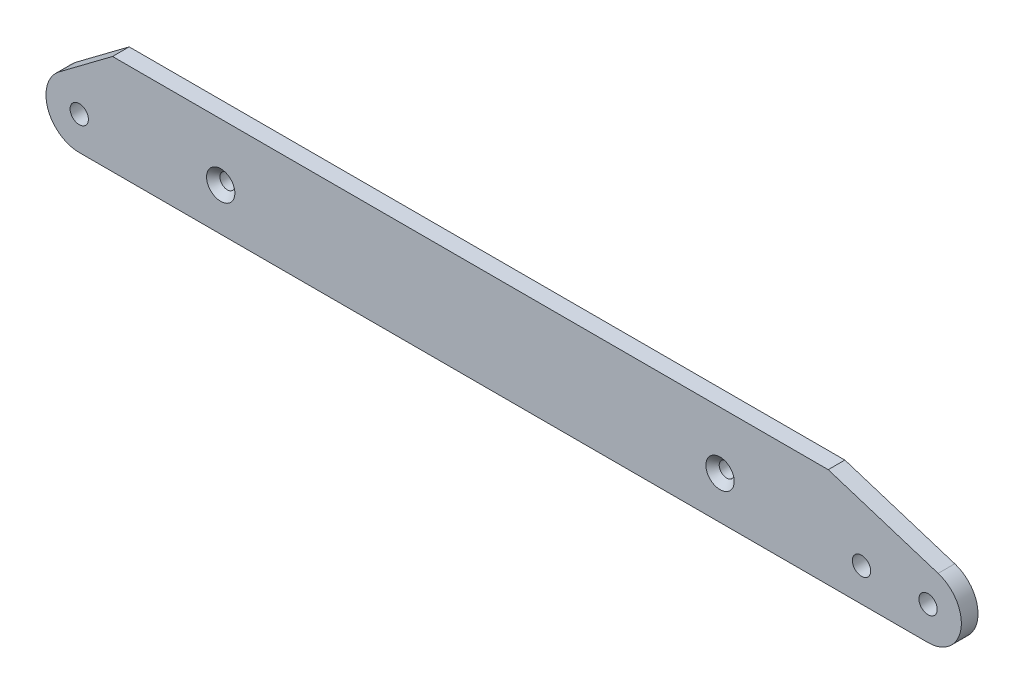
ISO-10303-21;
HEADER;
FILE_DESCRIPTION(('STEP AP214'),'2;1');
FILE_NAME('part.step','',(''),(''),'','','');
FILE_SCHEMA(('AUTOMOTIVE_DESIGN { 1 0 10303 214 1 1 1 1 }'));
ENDSEC;
DATA;
#1=APPLICATION_CONTEXT('core data for automotive mechanical design processes');
#2=APPLICATION_PROTOCOL_DEFINITION('international standard','automotive_design',2000,#1);
#3=PRODUCT_CONTEXT('',#1,'mechanical');
#4=PRODUCT('Part','Part','',(#3));
#5=PRODUCT_RELATED_PRODUCT_CATEGORY('part','',(#4));
#6=PRODUCT_DEFINITION_FORMATION('','',#4);
#7=PRODUCT_DEFINITION_CONTEXT('part definition',#1,'design');
#8=PRODUCT_DEFINITION('design','',#6,#7);
#9=PRODUCT_DEFINITION_SHAPE('','',#8);
#10=(LENGTH_UNIT() NAMED_UNIT(*) SI_UNIT(.MILLI.,.METRE.));
#11=(NAMED_UNIT(*) PLANE_ANGLE_UNIT() SI_UNIT($,.RADIAN.));
#12=(NAMED_UNIT(*) SI_UNIT($,.STERADIAN.) SOLID_ANGLE_UNIT());
#13=UNCERTAINTY_MEASURE_WITH_UNIT(LENGTH_MEASURE(1.E-05),#10,'distance_accuracy_value','');
#14=(GEOMETRIC_REPRESENTATION_CONTEXT(3) GLOBAL_UNCERTAINTY_ASSIGNED_CONTEXT((#13)) GLOBAL_UNIT_ASSIGNED_CONTEXT((#10,
#11,#12)) REPRESENTATION_CONTEXT('',''));
#15=CARTESIAN_POINT('',(0.,0.,0.));
#16=DIRECTION('',(0.,0.,1.));
#17=DIRECTION('',(1.,0.,0.));
#18=AXIS2_PLACEMENT_3D('',#15,#16,#17);
#19=CARTESIAN_POINT('',(-117.5,-2.79999999999998,2.5));
#20=DIRECTION('',(0.,0.,1.));
#21=DIRECTION('',(1.,0.,0.));
#22=AXIS2_PLACEMENT_3D('',#19,#20,#21);
#23=PLANE('',#22);
#24=CARTESIAN_POINT('',(75.,0.,2.5));
#25=DIRECTION('',(0.,0.,1.));
#26=DIRECTION('',(1.,0.,0.));
#27=AXIS2_PLACEMENT_3D('',#24,#25,#26);
#28=CIRCLE('',#27,4.25000000000003);
#29=CARTESIAN_POINT('',(79.25,0.,2.5));
#30=VERTEX_POINT('',#29);
#31=EDGE_CURVE('E49',#30,#30,#28,.F.);
#32=ORIENTED_EDGE('',*,*,#31,.T.);
#33=EDGE_LOOP('',(#32));
#34=FACE_BOUND('',#33,.T.);
#35=CARTESIAN_POINT('',(-75.,0.,2.5));
#36=DIRECTION('',(0.,0.,1.));
#37=DIRECTION('',(1.,0.,0.));
#38=AXIS2_PLACEMENT_3D('',#35,#36,#37);
#39=CIRCLE('',#38,4.25000000000003);
#40=CARTESIAN_POINT('',(-70.75,0.,2.5));
#41=VERTEX_POINT('',#40);
#42=EDGE_CURVE('E149',#41,#41,#39,.F.);
#43=ORIENTED_EDGE('',*,*,#42,.T.);
#44=EDGE_LOOP('',(#43));
#45=FACE_BOUND('',#44,.T.);
#46=CARTESIAN_POINT('',(117.5,-2.79999999999999,2.5));
#47=DIRECTION('',(0.,0.,1.));
#48=DIRECTION('',(1.,0.,0.));
#49=AXIS2_PLACEMENT_3D('',#46,#47,#48);
#50=CIRCLE('',#49,2.75000000000001);
#51=CARTESIAN_POINT('',(120.25,-2.79999999999999,2.5));
#52=VERTEX_POINT('',#51);
#53=EDGE_CURVE('E234',#52,#52,#50,.T.);
#54=ORIENTED_EDGE('',*,*,#53,.F.);
#55=EDGE_LOOP('',(#54));
#56=FACE_BOUND('',#55,.T.);
#57=CARTESIAN_POINT('',(-117.5,-2.79999999999998,2.5));
#58=DIRECTION('',(0.,0.,1.));
#59=DIRECTION('',(1.,0.,0.));
#60=AXIS2_PLACEMENT_3D('',#57,#58,#59);
#61=CIRCLE('',#60,10.);
#62=CARTESIAN_POINT('',(-123.5,5.20000000000004,2.5));
#63=VERTEX_POINT('',#62);
#64=CARTESIAN_POINT('',(-117.5,-12.8,2.5));
#65=VERTEX_POINT('',#64);
#66=EDGE_CURVE('E137',#63,#65,#61,.T.);
#67=ORIENTED_EDGE('',*,*,#66,.T.);
#68=DIRECTION('',(1.,0.,0.));
#69=VECTOR('',#68,1.);
#70=CARTESIAN_POINT('',(-117.5,-12.8,2.5));
#71=LINE('',#70,#69);
#72=CARTESIAN_POINT('',(137.5,-12.8,2.5));
#73=VERTEX_POINT('',#72);
#74=EDGE_CURVE('E95',#65,#73,#71,.T.);
#75=ORIENTED_EDGE('',*,*,#74,.T.);
#76=CARTESIAN_POINT('',(137.5,-2.80000000000002,2.5));
#77=DIRECTION('',(0.,0.,1.));
#78=DIRECTION('',(1.,0.,0.));
#79=AXIS2_PLACEMENT_3D('',#76,#77,#78);
#80=CIRCLE('',#79,10.);
#81=CARTESIAN_POINT('',(140.52169479252,6.73254218877941,2.5));
#82=VERTEX_POINT('',#81);
#83=EDGE_CURVE('E108',#73,#82,#80,.T.);
#84=ORIENTED_EDGE('',*,*,#83,.T.);
#85=DIRECTION('',(-0.953254218877943,0.302169479251963,0.));
#86=VECTOR('',#85,1.);
#87=CARTESIAN_POINT('',(107.5,17.2,2.5));
#88=LINE('',#87,#86);
#89=CARTESIAN_POINT('',(107.5,17.2,2.5));
#90=VERTEX_POINT('',#89);
#91=EDGE_CURVE('E102',#82,#90,#88,.T.);
#92=ORIENTED_EDGE('',*,*,#91,.T.);
#93=DIRECTION('',(-1.,0.,0.));
#94=VECTOR('',#93,1.);
#95=CARTESIAN_POINT('',(107.5,17.2,2.5));
#96=LINE('',#95,#94);
#97=CARTESIAN_POINT('',(-107.5,17.2,2.5));
#98=VERTEX_POINT('',#97);
#99=EDGE_CURVE('E106',#90,#98,#96,.T.);
#100=ORIENTED_EDGE('',*,*,#99,.T.);
#101=DIRECTION('',(-0.800000000000001,-0.599999999999998,0.));
#102=VECTOR('',#101,1.);
#103=CARTESIAN_POINT('',(-107.5,17.2,2.5));
#104=LINE('',#103,#102);
#105=EDGE_CURVE('E57',#98,#63,#104,.T.);
#106=ORIENTED_EDGE('',*,*,#105,.T.);
#107=EDGE_LOOP('',(#67,#75,#84,#92,#100,#106));
#108=FACE_BOUND('',#107,.T.);
#109=CARTESIAN_POINT('',(-117.5,-2.79999999999998,2.5));
#110=DIRECTION('',(0.,0.,1.));
#111=DIRECTION('',(1.,0.,0.));
#112=AXIS2_PLACEMENT_3D('',#109,#110,#111);
#113=CIRCLE('',#112,2.75000000000001);
#114=CARTESIAN_POINT('',(-114.75,-2.79999999999998,2.5));
#115=VERTEX_POINT('',#114);
#116=EDGE_CURVE('E172',#115,#115,#113,.T.);
#117=ORIENTED_EDGE('',*,*,#116,.F.);
#118=EDGE_LOOP('',(#117));
#119=FACE_BOUND('',#118,.T.);
#120=CARTESIAN_POINT('',(137.5,-2.80000000000002,2.5));
#121=DIRECTION('',(0.,0.,1.));
#122=DIRECTION('',(1.,0.,0.));
#123=AXIS2_PLACEMENT_3D('',#120,#121,#122);
#124=CIRCLE('',#123,2.75000000000001);
#125=CARTESIAN_POINT('',(140.25,-2.80000000000002,2.5));
#126=VERTEX_POINT('',#125);
#127=EDGE_CURVE('E225',#126,#126,#124,.T.);
#128=ORIENTED_EDGE('',*,*,#127,.F.);
#129=EDGE_LOOP('',(#128));
#130=FACE_BOUND('',#129,.T.);
#131=ADVANCED_FACE('F39',(#34,#45,#56,#108,#119,#130),#23,.T.);
#132=CARTESIAN_POINT('',(-117.5,-2.79999999999998,-2.5));
#133=DIRECTION('',(0.,0.,1.));
#134=DIRECTION('',(1.,0.,0.));
#135=AXIS2_PLACEMENT_3D('',#132,#133,#134);
#136=PLANE('',#135);
#137=CARTESIAN_POINT('',(-117.5,-2.79999999999998,-2.5));
#138=DIRECTION('',(0.,0.,1.));
#139=DIRECTION('',(1.,0.,0.));
#140=AXIS2_PLACEMENT_3D('',#137,#138,#139);
#141=CIRCLE('',#140,10.);
#142=CARTESIAN_POINT('',(-123.5,5.20000000000004,-2.5));
#143=VERTEX_POINT('',#142);
#144=CARTESIAN_POINT('',(-117.5,-12.8,-2.5));
#145=VERTEX_POINT('',#144);
#146=EDGE_CURVE('E126',#143,#145,#141,.T.);
#147=ORIENTED_EDGE('',*,*,#146,.F.);
#148=DIRECTION('',(-0.800000000000001,-0.599999999999998,0.));
#149=VECTOR('',#148,1.);
#150=CARTESIAN_POINT('',(-107.5,17.2,-2.5));
#151=LINE('',#150,#149);
#152=CARTESIAN_POINT('',(-107.5,17.2,-2.5));
#153=VERTEX_POINT('',#152);
#154=EDGE_CURVE('E86',#153,#143,#151,.T.);
#155=ORIENTED_EDGE('',*,*,#154,.F.);
#156=DIRECTION('',(-1.,0.,0.));
#157=VECTOR('',#156,1.);
#158=CARTESIAN_POINT('',(107.5,17.2,-2.5));
#159=LINE('',#158,#157);
#160=CARTESIAN_POINT('',(107.5,17.2,-2.5));
#161=VERTEX_POINT('',#160);
#162=EDGE_CURVE('E80',#161,#153,#159,.T.);
#163=ORIENTED_EDGE('',*,*,#162,.F.);
#164=DIRECTION('',(-0.953254218877943,0.302169479251963,0.));
#165=VECTOR('',#164,1.);
#166=CARTESIAN_POINT('',(107.5,17.2,-2.5));
#167=LINE('',#166,#165);
#168=CARTESIAN_POINT('',(140.52169479252,6.73254218877941,-2.5));
#169=VERTEX_POINT('',#168);
#170=EDGE_CURVE('E116',#169,#161,#167,.T.);
#171=ORIENTED_EDGE('',*,*,#170,.F.);
#172=CARTESIAN_POINT('',(137.5,-2.80000000000002,-2.5));
#173=DIRECTION('',(0.,0.,1.));
#174=DIRECTION('',(1.,0.,0.));
#175=AXIS2_PLACEMENT_3D('',#172,#173,#174);
#176=CIRCLE('',#175,10.);
#177=CARTESIAN_POINT('',(137.5,-12.8,-2.5));
#178=VERTEX_POINT('',#177);
#179=EDGE_CURVE('E132',#178,#169,#176,.T.);
#180=ORIENTED_EDGE('',*,*,#179,.F.);
#181=DIRECTION('',(1.,0.,0.));
#182=VECTOR('',#181,1.);
#183=CARTESIAN_POINT('',(-117.5,-12.8,-2.5));
#184=LINE('',#183,#182);
#185=EDGE_CURVE('E129',#145,#178,#184,.T.);
#186=ORIENTED_EDGE('',*,*,#185,.F.);
#187=EDGE_LOOP('',(#147,#155,#163,#171,#180,#186));
#188=FACE_BOUND('',#187,.T.);
#189=CARTESIAN_POINT('',(-75.,0.,-2.5));
#190=DIRECTION('',(0.,0.,1.));
#191=DIRECTION('',(1.,0.,0.));
#192=AXIS2_PLACEMENT_3D('',#189,#190,#191);
#193=CIRCLE('',#192,2.25);
#194=CARTESIAN_POINT('',(-72.75,0.,-2.5));
#195=VERTEX_POINT('',#194);
#196=EDGE_CURVE('E130',#195,#195,#193,.T.);
#197=ORIENTED_EDGE('',*,*,#196,.T.);
#198=EDGE_LOOP('',(#197));
#199=FACE_BOUND('',#198,.T.);
#200=CARTESIAN_POINT('',(75.,0.,-2.5));
#201=DIRECTION('',(0.,0.,1.));
#202=DIRECTION('',(1.,0.,0.));
#203=AXIS2_PLACEMENT_3D('',#200,#201,#202);
#204=CIRCLE('',#203,2.25);
#205=CARTESIAN_POINT('',(77.25,0.,-2.5));
#206=VERTEX_POINT('',#205);
#207=EDGE_CURVE('E170',#206,#206,#204,.T.);
#208=ORIENTED_EDGE('',*,*,#207,.T.);
#209=EDGE_LOOP('',(#208));
#210=FACE_BOUND('',#209,.T.);
#211=CARTESIAN_POINT('',(-117.5,-2.79999999999998,-2.5));
#212=DIRECTION('',(0.,0.,1.));
#213=DIRECTION('',(1.,0.,0.));
#214=AXIS2_PLACEMENT_3D('',#211,#212,#213);
#215=CIRCLE('',#214,2.75000000000001);
#216=CARTESIAN_POINT('',(-114.75,-2.79999999999998,-2.5));
#217=VERTEX_POINT('',#216);
#218=EDGE_CURVE('E177',#217,#217,#215,.T.);
#219=ORIENTED_EDGE('',*,*,#218,.T.);
#220=EDGE_LOOP('',(#219));
#221=FACE_BOUND('',#220,.T.);
#222=CARTESIAN_POINT('',(117.5,-2.79999999999999,-2.5));
#223=DIRECTION('',(0.,0.,1.));
#224=DIRECTION('',(1.,0.,0.));
#225=AXIS2_PLACEMENT_3D('',#222,#223,#224);
#226=CIRCLE('',#225,2.75000000000001);
#227=CARTESIAN_POINT('',(120.25,-2.79999999999999,-2.5));
#228=VERTEX_POINT('',#227);
#229=EDGE_CURVE('E231',#228,#228,#226,.T.);
#230=ORIENTED_EDGE('',*,*,#229,.T.);
#231=EDGE_LOOP('',(#230));
#232=FACE_BOUND('',#231,.T.);
#233=CARTESIAN_POINT('',(137.5,-2.80000000000002,-2.5));
#234=DIRECTION('',(0.,0.,1.));
#235=DIRECTION('',(1.,0.,0.));
#236=AXIS2_PLACEMENT_3D('',#233,#234,#235);
#237=CIRCLE('',#236,2.75000000000001);
#238=CARTESIAN_POINT('',(140.25,-2.80000000000002,-2.5));
#239=VERTEX_POINT('',#238);
#240=EDGE_CURVE('E228',#239,#239,#237,.T.);
#241=ORIENTED_EDGE('',*,*,#240,.T.);
#242=EDGE_LOOP('',(#241));
#243=FACE_BOUND('',#242,.T.);
#244=ADVANCED_FACE('F190',(#188,#199,#210,#221,#232,#243),#136,.F.);
#245=CARTESIAN_POINT('',(-117.5,-2.79999999999998,2.5));
#246=DIRECTION('',(0.,0.,-1.));
#247=DIRECTION('',(-1.,0.,0.));
#248=AXIS2_PLACEMENT_3D('',#245,#246,#247);
#249=CYLINDRICAL_SURFACE('',#248,10.);
#250=ORIENTED_EDGE('',*,*,#146,.T.);
#251=DIRECTION('',(0.,0.,-1.));
#252=VECTOR('',#251,1.);
#253=CARTESIAN_POINT('',(-117.5,-12.8,2.5));
#254=LINE('',#253,#252);
#255=EDGE_CURVE('E144',#65,#145,#254,.T.);
#256=ORIENTED_EDGE('',*,*,#255,.F.);
#257=ORIENTED_EDGE('',*,*,#66,.F.);
#258=DIRECTION('',(0.,0.,-1.));
#259=VECTOR('',#258,1.);
#260=CARTESIAN_POINT('',(-123.5,5.20000000000004,2.5));
#261=LINE('',#260,#259);
#262=EDGE_CURVE('E122',#63,#143,#261,.T.);
#263=ORIENTED_EDGE('',*,*,#262,.T.);
#264=EDGE_LOOP('',(#250,#256,#257,#263));
#265=FACE_BOUND('',#264,.T.);
#266=ADVANCED_FACE('F193',(#265),#249,.T.);
#267=CARTESIAN_POINT('',(-117.5,-12.8,2.5));
#268=DIRECTION('',(0.,1.,0.));
#269=DIRECTION('',(-1.,0.,0.));
#270=AXIS2_PLACEMENT_3D('',#267,#268,#269);
#271=PLANE('',#270);
#272=ORIENTED_EDGE('',*,*,#185,.T.);
#273=DIRECTION('',(0.,0.,-1.));
#274=VECTOR('',#273,1.);
#275=CARTESIAN_POINT('',(137.5,-12.8,2.5));
#276=LINE('',#275,#274);
#277=EDGE_CURVE('E141',#73,#178,#276,.T.);
#278=ORIENTED_EDGE('',*,*,#277,.F.);
#279=ORIENTED_EDGE('',*,*,#74,.F.);
#280=ORIENTED_EDGE('',*,*,#255,.T.);
#281=EDGE_LOOP('',(#272,#278,#279,#280));
#282=FACE_BOUND('',#281,.T.);
#283=ADVANCED_FACE('F184',(#282),#271,.F.);
#284=CARTESIAN_POINT('',(137.5,-2.80000000000002,2.5));
#285=DIRECTION('',(0.,0.,-1.));
#286=DIRECTION('',(-1.,0.,0.));
#287=AXIS2_PLACEMENT_3D('',#284,#285,#286);
#288=CYLINDRICAL_SURFACE('',#287,10.);
#289=ORIENTED_EDGE('',*,*,#179,.T.);
#290=DIRECTION('',(0.,0.,-1.));
#291=VECTOR('',#290,1.);
#292=CARTESIAN_POINT('',(140.52169479252,6.73254218877941,2.5));
#293=LINE('',#292,#291);
#294=EDGE_CURVE('E117',#82,#169,#293,.T.);
#295=ORIENTED_EDGE('',*,*,#294,.F.);
#296=ORIENTED_EDGE('',*,*,#83,.F.);
#297=ORIENTED_EDGE('',*,*,#277,.T.);
#298=EDGE_LOOP('',(#289,#295,#296,#297));
#299=FACE_BOUND('',#298,.T.);
#300=ADVANCED_FACE('F187',(#299),#288,.T.);
#301=CARTESIAN_POINT('',(107.5,17.2,2.5));
#302=DIRECTION('',(-0.302169479251963,-0.953254218877943,0.));
#303=DIRECTION('',(0.953254218877943,-0.302169479251963,0.));
#304=AXIS2_PLACEMENT_3D('',#301,#302,#303);
#305=PLANE('',#304);
#306=ORIENTED_EDGE('',*,*,#170,.T.);
#307=DIRECTION('',(0.,0.,-1.));
#308=VECTOR('',#307,1.);
#309=CARTESIAN_POINT('',(107.5,17.2,2.5));
#310=LINE('',#309,#308);
#311=EDGE_CURVE('E113',#90,#161,#310,.T.);
#312=ORIENTED_EDGE('',*,*,#311,.F.);
#313=ORIENTED_EDGE('',*,*,#91,.F.);
#314=ORIENTED_EDGE('',*,*,#294,.T.);
#315=EDGE_LOOP('',(#306,#312,#313,#314));
#316=FACE_BOUND('',#315,.T.);
#317=ADVANCED_FACE('F114',(#316),#305,.F.);
#318=CARTESIAN_POINT('',(107.5,17.2,2.5));
#319=DIRECTION('',(0.,-1.,0.));
#320=DIRECTION('',(1.,0.,0.));
#321=AXIS2_PLACEMENT_3D('',#318,#319,#320);
#322=PLANE('',#321);
#323=ORIENTED_EDGE('',*,*,#162,.T.);
#324=DIRECTION('',(0.,0.,-1.));
#325=VECTOR('',#324,1.);
#326=CARTESIAN_POINT('',(-107.5,17.2,2.5));
#327=LINE('',#326,#325);
#328=EDGE_CURVE('E118',#98,#153,#327,.T.);
#329=ORIENTED_EDGE('',*,*,#328,.F.);
#330=ORIENTED_EDGE('',*,*,#99,.F.);
#331=ORIENTED_EDGE('',*,*,#311,.T.);
#332=EDGE_LOOP('',(#323,#329,#330,#331));
#333=FACE_BOUND('',#332,.T.);
#334=ADVANCED_FACE('F120',(#333),#322,.F.);
#335=CARTESIAN_POINT('',(-107.5,17.2,2.5));
#336=DIRECTION('',(0.599999999999998,-0.800000000000001,0.));
#337=DIRECTION('',(0.800000000000001,0.599999999999998,0.));
#338=AXIS2_PLACEMENT_3D('',#335,#336,#337);
#339=PLANE('',#338);
#340=ORIENTED_EDGE('',*,*,#154,.T.);
#341=ORIENTED_EDGE('',*,*,#262,.F.);
#342=ORIENTED_EDGE('',*,*,#105,.F.);
#343=ORIENTED_EDGE('',*,*,#328,.T.);
#344=EDGE_LOOP('',(#340,#341,#342,#343));
#345=FACE_BOUND('',#344,.T.);
#346=ADVANCED_FACE('F194',(#345),#339,.F.);
#347=CARTESIAN_POINT('',(-75.,0.,2.5));
#348=DIRECTION('',(0.,0.,-1.));
#349=DIRECTION('',(-1.,0.,0.));
#350=AXIS2_PLACEMENT_3D('',#347,#348,#349);
#351=CYLINDRICAL_SURFACE('',#350,2.25);
#352=CARTESIAN_POINT('',(-75.,0.,0.499999999999957));
#353=DIRECTION('',(0.,0.,1.));
#354=DIRECTION('',(1.,0.,0.));
#355=AXIS2_PLACEMENT_3D('',#352,#353,#354);
#356=CIRCLE('',#355,2.25);
#357=CARTESIAN_POINT('',(-72.75,0.,0.499999999999957));
#358=VERTEX_POINT('',#357);
#359=EDGE_CURVE('E11',#358,#358,#356,.T.);
#360=ORIENTED_EDGE('',*,*,#359,.T.);
#361=EDGE_LOOP('',(#360));
#362=FACE_BOUND('',#361,.T.);
#363=ORIENTED_EDGE('',*,*,#196,.F.);
#364=EDGE_LOOP('',(#363));
#365=FACE_BOUND('',#364,.T.);
#366=ADVANCED_FACE('F166',(#362,#365),#351,.F.);
#367=CARTESIAN_POINT('',(75.,0.,2.5));
#368=DIRECTION('',(0.,0.,-1.));
#369=DIRECTION('',(-1.,0.,0.));
#370=AXIS2_PLACEMENT_3D('',#367,#368,#369);
#371=CYLINDRICAL_SURFACE('',#370,2.25);
#372=CARTESIAN_POINT('',(75.,0.,0.499999999999957));
#373=DIRECTION('',(0.,0.,1.));
#374=DIRECTION('',(1.,0.,0.));
#375=AXIS2_PLACEMENT_3D('',#372,#373,#374);
#376=CIRCLE('',#375,2.25);
#377=CARTESIAN_POINT('',(77.25,0.,0.499999999999957));
#378=VERTEX_POINT('',#377);
#379=EDGE_CURVE('E146',#378,#378,#376,.T.);
#380=ORIENTED_EDGE('',*,*,#379,.T.);
#381=EDGE_LOOP('',(#380));
#382=FACE_BOUND('',#381,.T.);
#383=ORIENTED_EDGE('',*,*,#207,.F.);
#384=EDGE_LOOP('',(#383));
#385=FACE_BOUND('',#384,.T.);
#386=ADVANCED_FACE('F162',(#382,#385),#371,.F.);
#387=CARTESIAN_POINT('',(-117.5,-2.79999999999998,2.5));
#388=DIRECTION('',(0.,0.,-1.));
#389=DIRECTION('',(-1.,0.,0.));
#390=AXIS2_PLACEMENT_3D('',#387,#388,#389);
#391=CYLINDRICAL_SURFACE('',#390,2.75000000000001);
#392=ORIENTED_EDGE('',*,*,#116,.T.);
#393=EDGE_LOOP('',(#392));
#394=FACE_BOUND('',#393,.T.);
#395=ORIENTED_EDGE('',*,*,#218,.F.);
#396=EDGE_LOOP('',(#395));
#397=FACE_BOUND('',#396,.T.);
#398=ADVANCED_FACE('F165',(#394,#397),#391,.F.);
#399=CARTESIAN_POINT('',(117.5,-2.79999999999999,2.5));
#400=DIRECTION('',(0.,0.,-1.));
#401=DIRECTION('',(-1.,0.,0.));
#402=AXIS2_PLACEMENT_3D('',#399,#400,#401);
#403=CYLINDRICAL_SURFACE('',#402,2.75000000000001);
#404=ORIENTED_EDGE('',*,*,#53,.T.);
#405=EDGE_LOOP('',(#404));
#406=FACE_BOUND('',#405,.T.);
#407=ORIENTED_EDGE('',*,*,#229,.F.);
#408=EDGE_LOOP('',(#407));
#409=FACE_BOUND('',#408,.T.);
#410=ADVANCED_FACE('F213',(#406,#409),#403,.F.);
#411=CARTESIAN_POINT('',(137.5,-2.80000000000002,2.5));
#412=DIRECTION('',(0.,0.,-1.));
#413=DIRECTION('',(-1.,0.,0.));
#414=AXIS2_PLACEMENT_3D('',#411,#412,#413);
#415=CYLINDRICAL_SURFACE('',#414,2.75000000000001);
#416=ORIENTED_EDGE('',*,*,#127,.T.);
#417=EDGE_LOOP('',(#416));
#418=FACE_BOUND('',#417,.T.);
#419=ORIENTED_EDGE('',*,*,#240,.F.);
#420=EDGE_LOOP('',(#419));
#421=FACE_BOUND('',#420,.T.);
#422=ADVANCED_FACE('F159',(#418,#421),#415,.F.);
#423=CARTESIAN_POINT('',(75.,0.,0.499999999999957));
#424=DIRECTION('',(0.,0.,1.));
#425=DIRECTION('',(1.,0.,0.));
#426=AXIS2_PLACEMENT_3D('',#423,#424,#425);
#427=CONICAL_SURFACE('',#426,2.25,0.785398163397446);
#428=ORIENTED_EDGE('',*,*,#31,.F.);
#429=EDGE_LOOP('',(#428));
#430=FACE_BOUND('',#429,.T.);
#431=ORIENTED_EDGE('',*,*,#379,.F.);
#432=EDGE_LOOP('',(#431));
#433=FACE_BOUND('',#432,.T.);
#434=ADVANCED_FACE('F156',(#430,#433),#427,.F.);
#435=CARTESIAN_POINT('',(-75.,0.,0.499999999999957));
#436=DIRECTION('',(0.,0.,1.));
#437=DIRECTION('',(1.,0.,0.));
#438=AXIS2_PLACEMENT_3D('',#435,#436,#437);
#439=CONICAL_SURFACE('',#438,2.25,0.785398163397446);
#440=ORIENTED_EDGE('',*,*,#42,.F.);
#441=EDGE_LOOP('',(#440));
#442=FACE_BOUND('',#441,.T.);
#443=ORIENTED_EDGE('',*,*,#359,.F.);
#444=EDGE_LOOP('',(#443));
#445=FACE_BOUND('',#444,.T.);
#446=ADVANCED_FACE('F42',(#442,#445),#439,.F.);
#447=CLOSED_SHELL('',(#131,#244,#266,#283,#300,#317,#334,#346,#366,#386,#398,#410,#422,#434,#446));
#448=MANIFOLD_SOLID_BREP('B2',#447);
#449=ADVANCED_BREP_SHAPE_REPRESENTATION('',(#18,#448),#14);
#450=SHAPE_DEFINITION_REPRESENTATION(#9,#449);
ENDSEC;
END-ISO-10303-21;
